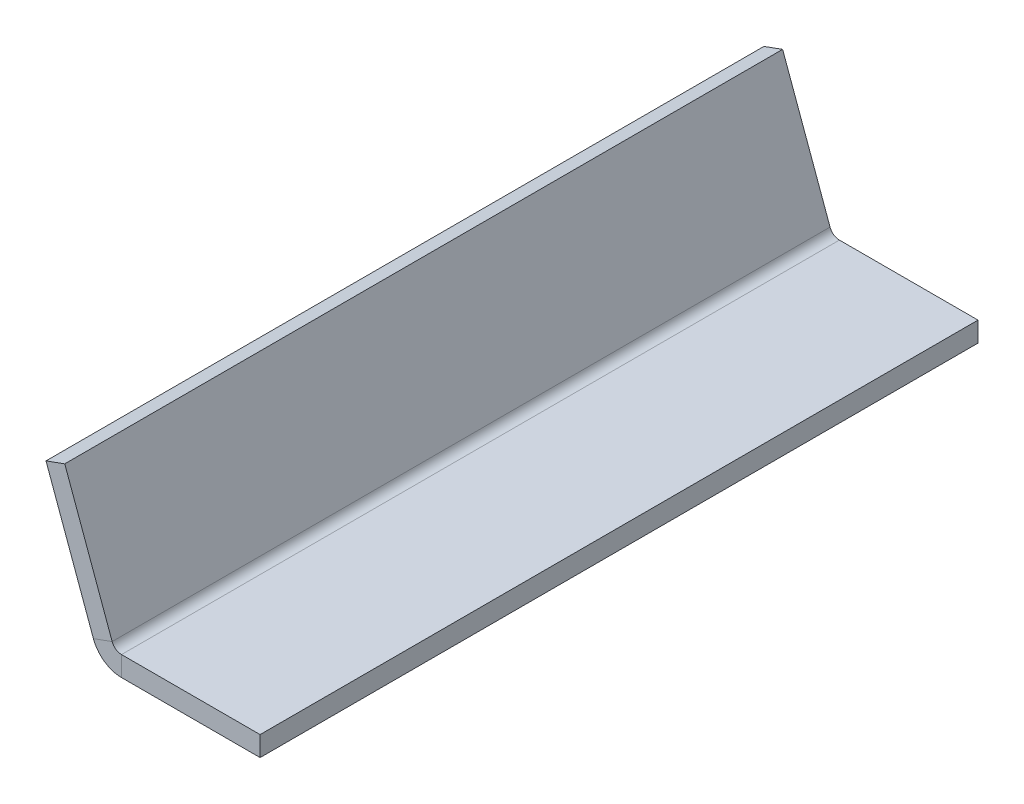
ISO-10303-21;
HEADER;
FILE_DESCRIPTION(('STEP AP214'),'2;1');
FILE_NAME('part.step','',(''),(''),'','','');
FILE_SCHEMA(('AUTOMOTIVE_DESIGN { 1 0 10303 214 1 1 1 1 }'));
ENDSEC;
DATA;
#1=APPLICATION_CONTEXT('core data for automotive mechanical design processes');
#2=APPLICATION_PROTOCOL_DEFINITION('international standard','automotive_design',2000,#1);
#3=PRODUCT_CONTEXT('',#1,'mechanical');
#4=PRODUCT('Part','Part','',(#3));
#5=PRODUCT_RELATED_PRODUCT_CATEGORY('part','',(#4));
#6=PRODUCT_DEFINITION_FORMATION('','',#4);
#7=PRODUCT_DEFINITION_CONTEXT('part definition',#1,'design');
#8=PRODUCT_DEFINITION('design','',#6,#7);
#9=PRODUCT_DEFINITION_SHAPE('','',#8);
#10=(LENGTH_UNIT() NAMED_UNIT(*) SI_UNIT(.MILLI.,.METRE.));
#11=(NAMED_UNIT(*) PLANE_ANGLE_UNIT() SI_UNIT($,.RADIAN.));
#12=(NAMED_UNIT(*) SI_UNIT($,.STERADIAN.) SOLID_ANGLE_UNIT());
#13=UNCERTAINTY_MEASURE_WITH_UNIT(LENGTH_MEASURE(1.E-05),#10,'distance_accuracy_value','');
#14=(GEOMETRIC_REPRESENTATION_CONTEXT(3) GLOBAL_UNCERTAINTY_ASSIGNED_CONTEXT((#13)) GLOBAL_UNIT_ASSIGNED_CONTEXT((#10,
#11,#12)) REPRESENTATION_CONTEXT('',''));
#15=CARTESIAN_POINT('',(0.,0.,0.));
#16=DIRECTION('',(0.,0.,1.));
#17=DIRECTION('',(1.,0.,0.));
#18=AXIS2_PLACEMENT_3D('',#15,#16,#17);
#19=CARTESIAN_POINT('',(-3.592276238643,9.86969785011491,360.));
#20=DIRECTION('',(0.,0.,1.));
#21=DIRECTION('',(1.,0.,0.));
#22=AXIS2_PLACEMENT_3D('',#19,#20,#21);
#23=PLANE('',#22);
#24=DIRECTION('',(0.939692620785907,0.342020143325673,0.));
#25=VECTOR('',#24,1.);
#26=CARTESIAN_POINT('',(-3.592276238643,9.86969785011491,360.));
#27=LINE('',#26,#25);
#28=CARTESIAN_POINT('',(-3.592276238643,9.86969785011491,360.));
#29=VERTEX_POINT('',#28);
#30=CARTESIAN_POINT('',(5.80464996921606,13.2898992833716,360.));
#31=VERTEX_POINT('',#30);
#32=EDGE_CURVE('E11',#29,#31,#27,.T.);
#33=ORIENTED_EDGE('',*,*,#32,.F.);
#34=CARTESIAN_POINT('',(10.5031130731456,15.,360.));
#35=DIRECTION('',(0.,0.,1.));
#36=DIRECTION('',(1.,0.,0.));
#37=AXIS2_PLACEMENT_3D('',#34,#35,#36);
#38=CIRCLE('',#37,15.);
#39=CARTESIAN_POINT('',(10.5031130731456,0.,360.));
#40=VERTEX_POINT('',#39);
#41=EDGE_CURVE('E137',#40,#29,#38,.F.);
#42=ORIENTED_EDGE('',*,*,#41,.F.);
#43=DIRECTION('',(0.,-1.,0.));
#44=VECTOR('',#43,1.);
#45=CARTESIAN_POINT('',(10.5031130731456,10.,360.));
#46=LINE('',#45,#44);
#47=CARTESIAN_POINT('',(10.5031130731456,10.,360.));
#48=VERTEX_POINT('',#47);
#49=EDGE_CURVE('E48',#48,#40,#46,.T.);
#50=ORIENTED_EDGE('',*,*,#49,.F.);
#51=CARTESIAN_POINT('',(10.5031130731456,15.,360.));
#52=DIRECTION('',(0.,0.,1.));
#53=DIRECTION('',(1.,0.,0.));
#54=AXIS2_PLACEMENT_3D('',#51,#52,#53);
#55=CIRCLE('',#54,5.);
#56=EDGE_CURVE('E130',#48,#31,#55,.F.);
#57=ORIENTED_EDGE('',*,*,#56,.T.);
#58=EDGE_LOOP('',(#33,#42,#50,#57));
#59=FACE_BOUND('',#58,.T.);
#60=ADVANCED_FACE('F40',(#59),#23,.T.);
#61=CARTESIAN_POINT('',(10.5031130731456,10.,360.));
#62=DIRECTION('',(0.,0.,1.));
#63=DIRECTION('',(1.,0.,0.));
#64=AXIS2_PLACEMENT_3D('',#61,#62,#63);
#65=PLANE('',#64);
#66=DIRECTION('',(-0.342020143325673,0.939692620785907,0.));
#67=VECTOR('',#66,1.);
#68=CARTESIAN_POINT('',(0.,0.,360.));
#69=LINE('',#68,#67);
#70=CARTESIAN_POINT('',(-27.3616114660538,75.1754096628726,360.));
#71=VERTEX_POINT('',#70);
#72=EDGE_CURVE('E186',#29,#71,#69,.T.);
#73=ORIENTED_EDGE('',*,*,#72,.F.);
#74=ORIENTED_EDGE('',*,*,#32,.T.);
#75=DIRECTION('',(-0.342020143325673,0.939692620785907,0.));
#76=VECTOR('',#75,1.);
#77=CARTESIAN_POINT('',(9.39692620785907,3.42020143325673,360.));
#78=LINE('',#77,#76);
#79=CARTESIAN_POINT('',(-17.9646852581947,78.5956110961293,360.));
#80=VERTEX_POINT('',#79);
#81=EDGE_CURVE('E96',#31,#80,#78,.T.);
#82=ORIENTED_EDGE('',*,*,#81,.T.);
#83=DIRECTION('',(0.939692620785907,0.342020143325673,0.));
#84=VECTOR('',#83,1.);
#85=CARTESIAN_POINT('',(-27.3616114660538,75.1754096628726,360.));
#86=LINE('',#85,#84);
#87=EDGE_CURVE('E343',#71,#80,#86,.T.);
#88=ORIENTED_EDGE('',*,*,#87,.F.);
#89=EDGE_LOOP('',(#73,#74,#82,#88));
#90=FACE_BOUND('',#89,.T.);
#91=ADVANCED_FACE('F194',(#90),#65,.T.);
#92=CARTESIAN_POINT('',(10.5031130731456,0.,0.));
#93=DIRECTION('',(0.,0.,-1.));
#94=DIRECTION('',(-1.,0.,0.));
#95=AXIS2_PLACEMENT_3D('',#92,#93,#94);
#96=PLANE('',#95);
#97=DIRECTION('',(0.,1.,0.));
#98=VECTOR('',#97,1.);
#99=CARTESIAN_POINT('',(10.5031130731456,0.,0.));
#100=LINE('',#99,#98);
#101=CARTESIAN_POINT('',(10.5031130731456,0.,0.));
#102=VERTEX_POINT('',#101);
#103=CARTESIAN_POINT('',(10.5031130731456,10.,0.));
#104=VERTEX_POINT('',#103);
#105=EDGE_CURVE('E83',#102,#104,#100,.T.);
#106=ORIENTED_EDGE('',*,*,#105,.F.);
#107=CARTESIAN_POINT('',(10.5031130731456,15.,0.));
#108=DIRECTION('',(0.,0.,1.));
#109=DIRECTION('',(1.,0.,0.));
#110=AXIS2_PLACEMENT_3D('',#107,#108,#109);
#111=CIRCLE('',#110,15.);
#112=CARTESIAN_POINT('',(-3.592276238643,9.86969785011491,0.));
#113=VERTEX_POINT('',#112);
#114=EDGE_CURVE('E152',#102,#113,#111,.F.);
#115=ORIENTED_EDGE('',*,*,#114,.T.);
#116=DIRECTION('',(-0.939692620785907,-0.342020143325673,0.));
#117=VECTOR('',#116,1.);
#118=CARTESIAN_POINT('',(5.80464996921606,13.2898992833716,0.));
#119=LINE('',#118,#117);
#120=CARTESIAN_POINT('',(5.80464996921606,13.2898992833716,0.));
#121=VERTEX_POINT('',#120);
#122=EDGE_CURVE('E90',#121,#113,#119,.T.);
#123=ORIENTED_EDGE('',*,*,#122,.F.);
#124=CARTESIAN_POINT('',(10.5031130731456,15.,0.));
#125=DIRECTION('',(0.,0.,1.));
#126=DIRECTION('',(1.,0.,0.));
#127=AXIS2_PLACEMENT_3D('',#124,#125,#126);
#128=CIRCLE('',#127,5.);
#129=EDGE_CURVE('E159',#104,#121,#128,.F.);
#130=ORIENTED_EDGE('',*,*,#129,.F.);
#131=EDGE_LOOP('',(#106,#115,#123,#130));
#132=FACE_BOUND('',#131,.T.);
#133=ADVANCED_FACE('F192',(#132),#96,.T.);
#134=CARTESIAN_POINT('',(5.80464996921606,13.2898992833716,0.));
#135=DIRECTION('',(0.,0.,-1.));
#136=DIRECTION('',(-1.,0.,0.));
#137=AXIS2_PLACEMENT_3D('',#134,#135,#136);
#138=PLANE('',#137);
#139=DIRECTION('',(-1.,0.,0.));
#140=VECTOR('',#139,1.);
#141=CARTESIAN_POINT('',(0.,0.,0.));
#142=LINE('',#141,#140);
#143=CARTESIAN_POINT('',(80.,0.,0.));
#144=VERTEX_POINT('',#143);
#145=EDGE_CURVE('E154',#144,#102,#142,.T.);
#146=ORIENTED_EDGE('',*,*,#145,.T.);
#147=ORIENTED_EDGE('',*,*,#105,.T.);
#148=DIRECTION('',(1.,0.,0.));
#149=VECTOR('',#148,1.);
#150=CARTESIAN_POINT('',(0.,10.,0.));
#151=LINE('',#150,#149);
#152=CARTESIAN_POINT('',(80.,10.,0.));
#153=VERTEX_POINT('',#152);
#154=EDGE_CURVE('E157',#153,#104,#151,.F.);
#155=ORIENTED_EDGE('',*,*,#154,.F.);
#156=DIRECTION('',(0.,-1.,0.));
#157=VECTOR('',#156,1.);
#158=CARTESIAN_POINT('',(80.,10.,0.));
#159=LINE('',#158,#157);
#160=EDGE_CURVE('E118',#153,#144,#159,.T.);
#161=ORIENTED_EDGE('',*,*,#160,.T.);
#162=EDGE_LOOP('',(#146,#147,#155,#161));
#163=FACE_BOUND('',#162,.T.);
#164=ADVANCED_FACE('F188',(#163),#138,.T.);
#165=CARTESIAN_POINT('',(9.39692620785907,3.42020143325673,360.));
#166=DIRECTION('',(-0.939692620785907,-0.342020143325673,0.));
#167=DIRECTION('',(0.342020143325673,-0.939692620785907,0.));
#168=AXIS2_PLACEMENT_3D('',#165,#166,#167);
#169=PLANE('',#168);
#170=DIRECTION('',(-0.342020143325673,0.939692620785907,0.));
#171=VECTOR('',#170,1.);
#172=CARTESIAN_POINT('',(9.39692620785907,3.42020143325673,0.));
#173=LINE('',#172,#171);
#174=CARTESIAN_POINT('',(-17.9646852581947,78.5956110961293,0.));
#175=VERTEX_POINT('',#174);
#176=EDGE_CURVE('E143',#121,#175,#173,.T.);
#177=ORIENTED_EDGE('',*,*,#176,.T.);
#178=DIRECTION('',(0.,0.,-1.));
#179=VECTOR('',#178,1.);
#180=CARTESIAN_POINT('',(-17.9646852581947,78.5956110961293,360.));
#181=LINE('',#180,#179);
#182=EDGE_CURVE('E173',#80,#175,#181,.T.);
#183=ORIENTED_EDGE('',*,*,#182,.F.);
#184=ORIENTED_EDGE('',*,*,#81,.F.);
#185=DIRECTION('',(0.,0.,-1.));
#186=VECTOR('',#185,1.);
#187=CARTESIAN_POINT('',(5.80464996921606,13.2898992833716,360.));
#188=LINE('',#187,#186);
#189=EDGE_CURVE('E142',#31,#121,#188,.T.);
#190=ORIENTED_EDGE('',*,*,#189,.T.);
#191=EDGE_LOOP('',(#177,#183,#184,#190));
#192=FACE_BOUND('',#191,.T.);
#193=ADVANCED_FACE('F200',(#192),#169,.F.);
#194=CARTESIAN_POINT('',(-27.3616114660538,75.1754096628726,360.));
#195=DIRECTION('',(-0.342020143325673,0.939692620785907,0.));
#196=DIRECTION('',(-0.939692620785907,-0.342020143325673,0.));
#197=AXIS2_PLACEMENT_3D('',#194,#195,#196);
#198=PLANE('',#197);
#199=DIRECTION('',(0.939692620785907,0.342020143325673,0.));
#200=VECTOR('',#199,1.);
#201=CARTESIAN_POINT('',(-27.3616114660538,75.1754096628726,0.));
#202=LINE('',#201,#200);
#203=CARTESIAN_POINT('',(-27.3616114660538,75.1754096628726,0.));
#204=VERTEX_POINT('',#203);
#205=EDGE_CURVE('E146',#204,#175,#202,.T.);
#206=ORIENTED_EDGE('',*,*,#205,.F.);
#207=DIRECTION('',(0.,0.,-1.));
#208=VECTOR('',#207,1.);
#209=CARTESIAN_POINT('',(-27.3616114660538,75.1754096628726,360.));
#210=LINE('',#209,#208);
#211=EDGE_CURVE('E171',#71,#204,#210,.T.);
#212=ORIENTED_EDGE('',*,*,#211,.F.);
#213=ORIENTED_EDGE('',*,*,#87,.T.);
#214=ORIENTED_EDGE('',*,*,#182,.T.);
#215=EDGE_LOOP('',(#206,#212,#213,#214));
#216=FACE_BOUND('',#215,.T.);
#217=ADVANCED_FACE('F231',(#216),#198,.T.);
#218=CARTESIAN_POINT('',(0.,0.,360.));
#219=DIRECTION('',(-0.939692620785907,-0.342020143325673,0.));
#220=DIRECTION('',(0.342020143325673,-0.939692620785907,0.));
#221=AXIS2_PLACEMENT_3D('',#218,#219,#220);
#222=PLANE('',#221);
#223=DIRECTION('',(-0.342020143325673,0.939692620785907,0.));
#224=VECTOR('',#223,1.);
#225=CARTESIAN_POINT('',(0.,0.,0.));
#226=LINE('',#225,#224);
#227=EDGE_CURVE('E149',#113,#204,#226,.T.);
#228=ORIENTED_EDGE('',*,*,#227,.F.);
#229=DIRECTION('',(0.,0.,-1.));
#230=VECTOR('',#229,1.);
#231=CARTESIAN_POINT('',(-3.592276238643,9.86969785011491,360.));
#232=LINE('',#231,#230);
#233=EDGE_CURVE('E168',#29,#113,#232,.T.);
#234=ORIENTED_EDGE('',*,*,#233,.F.);
#235=ORIENTED_EDGE('',*,*,#72,.T.);
#236=ORIENTED_EDGE('',*,*,#211,.T.);
#237=EDGE_LOOP('',(#228,#234,#235,#236));
#238=FACE_BOUND('',#237,.T.);
#239=ADVANCED_FACE('F242',(#238),#222,.T.);
#240=CARTESIAN_POINT('',(10.5031130731456,15.,360.));
#241=DIRECTION('',(0.,0.,-1.));
#242=DIRECTION('',(-1.,0.,0.));
#243=AXIS2_PLACEMENT_3D('',#240,#241,#242);
#244=CYLINDRICAL_SURFACE('',#243,15.);
#245=ORIENTED_EDGE('',*,*,#114,.F.);
#246=DIRECTION('',(0.,0.,-1.));
#247=VECTOR('',#246,1.);
#248=CARTESIAN_POINT('',(10.5031130731456,0.,360.));
#249=LINE('',#248,#247);
#250=EDGE_CURVE('E165',#40,#102,#249,.T.);
#251=ORIENTED_EDGE('',*,*,#250,.F.);
#252=ORIENTED_EDGE('',*,*,#41,.T.);
#253=ORIENTED_EDGE('',*,*,#233,.T.);
#254=EDGE_LOOP('',(#245,#251,#252,#253));
#255=FACE_BOUND('',#254,.T.);
#256=ADVANCED_FACE('F182',(#255),#244,.T.);
#257=CARTESIAN_POINT('',(0.,0.,360.));
#258=DIRECTION('',(0.,-1.,0.));
#259=DIRECTION('',(0.,0.,-1.));
#260=AXIS2_PLACEMENT_3D('',#257,#258,#259);
#261=PLANE('',#260);
#262=ORIENTED_EDGE('',*,*,#145,.F.);
#263=DIRECTION('',(0.,0.,-1.));
#264=VECTOR('',#263,1.);
#265=CARTESIAN_POINT('',(80.,0.,360.));
#266=LINE('',#265,#264);
#267=CARTESIAN_POINT('',(80.,0.,360.));
#268=VERTEX_POINT('',#267);
#269=EDGE_CURVE('E120',#268,#144,#266,.T.);
#270=ORIENTED_EDGE('',*,*,#269,.F.);
#271=DIRECTION('',(-1.,0.,0.));
#272=VECTOR('',#271,1.);
#273=CARTESIAN_POINT('',(0.,0.,360.));
#274=LINE('',#273,#272);
#275=EDGE_CURVE('E135',#268,#40,#274,.T.);
#276=ORIENTED_EDGE('',*,*,#275,.T.);
#277=ORIENTED_EDGE('',*,*,#250,.T.);
#278=EDGE_LOOP('',(#262,#270,#276,#277));
#279=FACE_BOUND('',#278,.T.);
#280=ADVANCED_FACE('F187',(#279),#261,.T.);
#281=CARTESIAN_POINT('',(80.,10.,360.));
#282=DIRECTION('',(1.,0.,0.));
#283=DIRECTION('',(0.,0.,-1.));
#284=AXIS2_PLACEMENT_3D('',#281,#282,#283);
#285=PLANE('',#284);
#286=ORIENTED_EDGE('',*,*,#160,.F.);
#287=DIRECTION('',(0.,0.,-1.));
#288=VECTOR('',#287,1.);
#289=CARTESIAN_POINT('',(80.,10.,360.));
#290=LINE('',#289,#288);
#291=CARTESIAN_POINT('',(80.,10.,360.));
#292=VERTEX_POINT('',#291);
#293=EDGE_CURVE('E112',#292,#153,#290,.T.);
#294=ORIENTED_EDGE('',*,*,#293,.F.);
#295=DIRECTION('',(0.,-1.,0.));
#296=VECTOR('',#295,1.);
#297=CARTESIAN_POINT('',(80.,10.,360.));
#298=LINE('',#297,#296);
#299=EDGE_CURVE('E116',#292,#268,#298,.T.);
#300=ORIENTED_EDGE('',*,*,#299,.T.);
#301=ORIENTED_EDGE('',*,*,#269,.T.);
#302=EDGE_LOOP('',(#286,#294,#300,#301));
#303=FACE_BOUND('',#302,.T.);
#304=ADVANCED_FACE('F114',(#303),#285,.T.);
#305=CARTESIAN_POINT('',(0.,10.,360.));
#306=DIRECTION('',(0.,-1.,0.));
#307=DIRECTION('',(0.,0.,-1.));
#308=AXIS2_PLACEMENT_3D('',#305,#306,#307);
#309=PLANE('',#308);
#310=ORIENTED_EDGE('',*,*,#154,.T.);
#311=DIRECTION('',(0.,0.,-1.));
#312=VECTOR('',#311,1.);
#313=CARTESIAN_POINT('',(10.5031130731456,10.,360.));
#314=LINE('',#313,#312);
#315=EDGE_CURVE('E121',#48,#104,#314,.T.);
#316=ORIENTED_EDGE('',*,*,#315,.F.);
#317=DIRECTION('',(1.,0.,0.));
#318=VECTOR('',#317,1.);
#319=CARTESIAN_POINT('',(0.,10.,360.));
#320=LINE('',#319,#318);
#321=EDGE_CURVE('E125',#292,#48,#320,.F.);
#322=ORIENTED_EDGE('',*,*,#321,.F.);
#323=ORIENTED_EDGE('',*,*,#293,.T.);
#324=EDGE_LOOP('',(#310,#316,#322,#323));
#325=FACE_BOUND('',#324,.T.);
#326=ADVANCED_FACE('F126',(#325),#309,.F.);
#327=CARTESIAN_POINT('',(10.5031130731456,15.,360.));
#328=DIRECTION('',(0.,0.,-1.));
#329=DIRECTION('',(-1.,0.,0.));
#330=AXIS2_PLACEMENT_3D('',#327,#328,#329);
#331=CYLINDRICAL_SURFACE('',#330,5.);
#332=ORIENTED_EDGE('',*,*,#129,.T.);
#333=ORIENTED_EDGE('',*,*,#189,.F.);
#334=ORIENTED_EDGE('',*,*,#56,.F.);
#335=ORIENTED_EDGE('',*,*,#315,.T.);
#336=EDGE_LOOP('',(#332,#333,#334,#335));
#337=FACE_BOUND('',#336,.T.);
#338=ADVANCED_FACE('F190',(#337),#331,.F.);
#339=CARTESIAN_POINT('',(10.5031130731456,15.,360.));
#340=DIRECTION('',(0.,0.,1.));
#341=DIRECTION('',(1.,0.,0.));
#342=AXIS2_PLACEMENT_3D('',#339,#340,#341);
#343=PLANE('',#342);
#344=ORIENTED_EDGE('',*,*,#321,.T.);
#345=ORIENTED_EDGE('',*,*,#49,.T.);
#346=ORIENTED_EDGE('',*,*,#275,.F.);
#347=ORIENTED_EDGE('',*,*,#299,.F.);
#348=EDGE_LOOP('',(#344,#345,#346,#347));
#349=FACE_BOUND('',#348,.T.);
#350=ADVANCED_FACE('F133',(#349),#343,.T.);
#351=CARTESIAN_POINT('',(10.5031130731456,15.,0.));
#352=DIRECTION('',(0.,0.,1.));
#353=DIRECTION('',(1.,0.,0.));
#354=AXIS2_PLACEMENT_3D('',#351,#352,#353);
#355=PLANE('',#354);
#356=ORIENTED_EDGE('',*,*,#176,.F.);
#357=ORIENTED_EDGE('',*,*,#122,.T.);
#358=ORIENTED_EDGE('',*,*,#227,.T.);
#359=ORIENTED_EDGE('',*,*,#205,.T.);
#360=EDGE_LOOP('',(#356,#357,#358,#359));
#361=FACE_BOUND('',#360,.T.);
#362=ADVANCED_FACE('F308',(#361),#355,.F.);
#363=CLOSED_SHELL('',(#60,#91,#133,#164,#193,#217,#239,#256,#280,#304,#326,#338,#350,#362));
#364=MANIFOLD_SOLID_BREP('B2',#363);
#365=ADVANCED_BREP_SHAPE_REPRESENTATION('',(#18,#364),#14);
#366=SHAPE_DEFINITION_REPRESENTATION(#9,#365);
ENDSEC;
END-ISO-10303-21;
